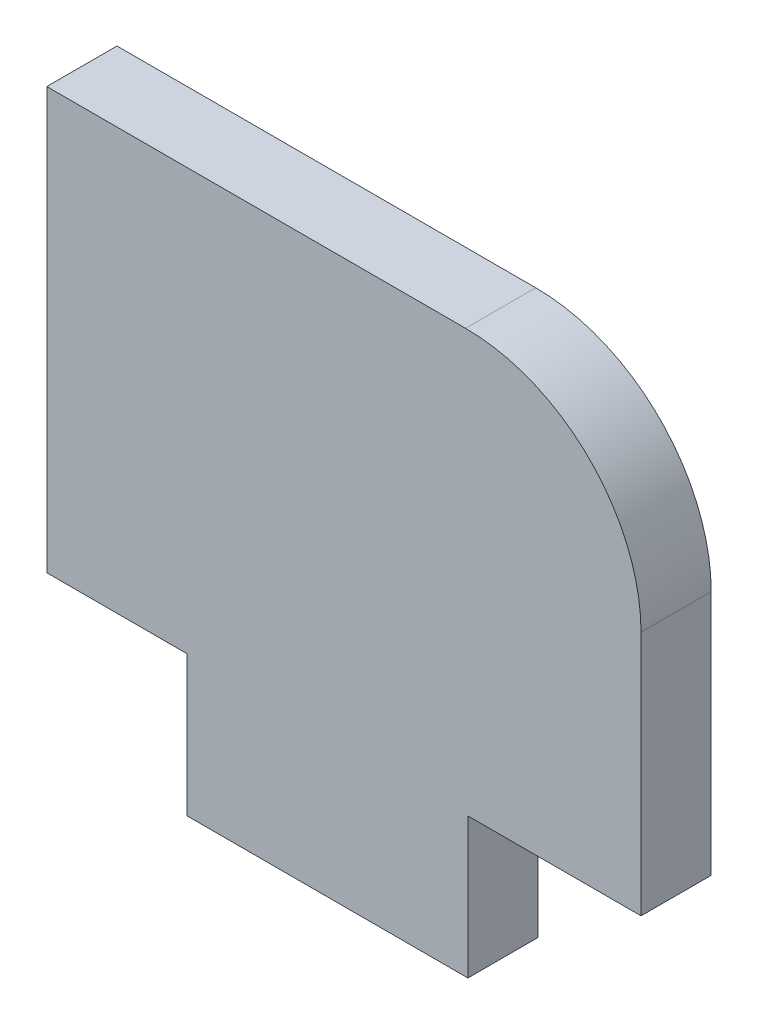
ISO-10303-21;
HEADER;
FILE_DESCRIPTION(('STEP AP214'),'2;1');
FILE_NAME('part.step','',(''),(''),'','','');
FILE_SCHEMA(('AUTOMOTIVE_DESIGN { 1 0 10303 214 1 1 1 1 }'));
ENDSEC;
DATA;
#1=APPLICATION_CONTEXT('core data for automotive mechanical design processes');
#2=APPLICATION_PROTOCOL_DEFINITION('international standard','automotive_design',2000,#1);
#3=PRODUCT_CONTEXT('',#1,'mechanical');
#4=PRODUCT('Part','Part','',(#3));
#5=PRODUCT_RELATED_PRODUCT_CATEGORY('part','',(#4));
#6=PRODUCT_DEFINITION_FORMATION('','',#4);
#7=PRODUCT_DEFINITION_CONTEXT('part definition',#1,'design');
#8=PRODUCT_DEFINITION('design','',#6,#7);
#9=PRODUCT_DEFINITION_SHAPE('','',#8);
#10=(LENGTH_UNIT() NAMED_UNIT(*) SI_UNIT(.MILLI.,.METRE.));
#11=(NAMED_UNIT(*) PLANE_ANGLE_UNIT() SI_UNIT($,.RADIAN.));
#12=(NAMED_UNIT(*) SI_UNIT($,.STERADIAN.) SOLID_ANGLE_UNIT());
#13=UNCERTAINTY_MEASURE_WITH_UNIT(LENGTH_MEASURE(1.E-05),#10,'distance_accuracy_value','');
#14=(GEOMETRIC_REPRESENTATION_CONTEXT(3) GLOBAL_UNCERTAINTY_ASSIGNED_CONTEXT((#13)) GLOBAL_UNIT_ASSIGNED_CONTEXT((#10,
#11,#12)) REPRESENTATION_CONTEXT('',''));
#15=CARTESIAN_POINT('',(0.,0.,0.));
#16=DIRECTION('',(0.,0.,1.));
#17=DIRECTION('',(1.,0.,0.));
#18=AXIS2_PLACEMENT_3D('',#15,#16,#17);
#19=CARTESIAN_POINT('',(-6.46658710236488,-4.,2.));
#20=DIRECTION('',(1.,0.,0.));
#21=DIRECTION('',(0.,0.,-1.));
#22=AXIS2_PLACEMENT_3D('',#19,#20,#21);
#23=PLANE('',#22);
#24=DIRECTION('',(0.,-1.,0.));
#25=VECTOR('',#24,1.);
#26=CARTESIAN_POINT('',(-6.46658710236488,-4.,0.));
#27=LINE('',#26,#25);
#28=CARTESIAN_POINT('',(-6.46658710236488,8.,0.));
#29=VERTEX_POINT('',#28);
#30=CARTESIAN_POINT('',(-6.46658710236488,-4.,0.));
#31=VERTEX_POINT('',#30);
#32=EDGE_CURVE('E135',#29,#31,#27,.T.);
#33=ORIENTED_EDGE('',*,*,#32,.T.);
#34=DIRECTION('',(0.,0.,-1.));
#35=VECTOR('',#34,1.);
#36=CARTESIAN_POINT('',(-6.46658710236488,-4.,2.));
#37=LINE('',#36,#35);
#38=CARTESIAN_POINT('',(-6.46658710236488,-4.,2.));
#39=VERTEX_POINT('',#38);
#40=EDGE_CURVE('E11',#39,#31,#37,.T.);
#41=ORIENTED_EDGE('',*,*,#40,.F.);
#42=DIRECTION('',(0.,-1.,0.));
#43=VECTOR('',#42,1.);
#44=CARTESIAN_POINT('',(-6.46658710236488,-4.,2.));
#45=LINE('',#44,#43);
#46=CARTESIAN_POINT('',(-6.46658710236488,8.,2.));
#47=VERTEX_POINT('',#46);
#48=EDGE_CURVE('E151',#47,#39,#45,.T.);
#49=ORIENTED_EDGE('',*,*,#48,.F.);
#50=DIRECTION('',(0.,0.,-1.));
#51=VECTOR('',#50,1.);
#52=CARTESIAN_POINT('',(-6.46658710236488,8.,2.));
#53=LINE('',#52,#51);
#54=EDGE_CURVE('E131',#47,#29,#53,.T.);
#55=ORIENTED_EDGE('',*,*,#54,.T.);
#56=EDGE_LOOP('',(#33,#41,#49,#55));
#57=FACE_BOUND('',#56,.T.);
#58=ADVANCED_FACE('F33',(#57),#23,.F.);
#59=CARTESIAN_POINT('',(-2.46658710236488,-4.,2.));
#60=DIRECTION('',(0.,1.,0.));
#61=DIRECTION('',(0.,0.,1.));
#62=AXIS2_PLACEMENT_3D('',#59,#60,#61);
#63=PLANE('',#62);
#64=DIRECTION('',(1.,0.,0.));
#65=VECTOR('',#64,1.);
#66=CARTESIAN_POINT('',(-2.46658710236488,-4.,0.));
#67=LINE('',#66,#65);
#68=CARTESIAN_POINT('',(-2.46658710236488,-4.,0.));
#69=VERTEX_POINT('',#68);
#70=EDGE_CURVE('E138',#31,#69,#67,.T.);
#71=ORIENTED_EDGE('',*,*,#70,.T.);
#72=DIRECTION('',(0.,0.,-1.));
#73=VECTOR('',#72,1.);
#74=CARTESIAN_POINT('',(-2.46658710236488,-4.,2.));
#75=LINE('',#74,#73);
#76=CARTESIAN_POINT('',(-2.46658710236488,-4.,2.));
#77=VERTEX_POINT('',#76);
#78=EDGE_CURVE('E41',#77,#69,#75,.T.);
#79=ORIENTED_EDGE('',*,*,#78,.F.);
#80=DIRECTION('',(1.,0.,0.));
#81=VECTOR('',#80,1.);
#82=CARTESIAN_POINT('',(-2.46658710236488,-4.,2.));
#83=LINE('',#82,#81);
#84=EDGE_CURVE('E95',#39,#77,#83,.T.);
#85=ORIENTED_EDGE('',*,*,#84,.F.);
#86=ORIENTED_EDGE('',*,*,#40,.T.);
#87=EDGE_LOOP('',(#71,#79,#85,#86));
#88=FACE_BOUND('',#87,.T.);
#89=ADVANCED_FACE('F194',(#88),#63,.F.);
#90=CARTESIAN_POINT('',(-2.46658710236488,-8.,2.));
#91=DIRECTION('',(1.,0.,0.));
#92=DIRECTION('',(0.,0.,-1.));
#93=AXIS2_PLACEMENT_3D('',#90,#91,#92);
#94=PLANE('',#93);
#95=DIRECTION('',(0.,-1.,0.));
#96=VECTOR('',#95,1.);
#97=CARTESIAN_POINT('',(-2.46658710236488,-8.,0.));
#98=LINE('',#97,#96);
#99=CARTESIAN_POINT('',(-2.46658710236488,-8.,0.));
#100=VERTEX_POINT('',#99);
#101=EDGE_CURVE('E140',#69,#100,#98,.T.);
#102=ORIENTED_EDGE('',*,*,#101,.T.);
#103=DIRECTION('',(0.,0.,-1.));
#104=VECTOR('',#103,1.);
#105=CARTESIAN_POINT('',(-2.46658710236488,-8.,2.));
#106=LINE('',#105,#104);
#107=CARTESIAN_POINT('',(-2.46658710236488,-8.,2.));
#108=VERTEX_POINT('',#107);
#109=EDGE_CURVE('E161',#108,#100,#106,.T.);
#110=ORIENTED_EDGE('',*,*,#109,.F.);
#111=DIRECTION('',(0.,-1.,0.));
#112=VECTOR('',#111,1.);
#113=CARTESIAN_POINT('',(-2.46658710236488,-8.,2.));
#114=LINE('',#113,#112);
#115=EDGE_CURVE('E169',#77,#108,#114,.T.);
#116=ORIENTED_EDGE('',*,*,#115,.F.);
#117=ORIENTED_EDGE('',*,*,#78,.T.);
#118=EDGE_LOOP('',(#102,#110,#116,#117));
#119=FACE_BOUND('',#118,.T.);
#120=ADVANCED_FACE('F167',(#119),#94,.F.);
#121=CARTESIAN_POINT('',(5.53341289763512,-8.,2.));
#122=DIRECTION('',(0.,1.,0.));
#123=DIRECTION('',(0.,0.,1.));
#124=AXIS2_PLACEMENT_3D('',#121,#122,#123);
#125=PLANE('',#124);
#126=DIRECTION('',(1.,0.,0.));
#127=VECTOR('',#126,1.);
#128=CARTESIAN_POINT('',(5.53341289763512,-8.,0.));
#129=LINE('',#128,#127);
#130=CARTESIAN_POINT('',(5.53341289763512,-8.,0.));
#131=VERTEX_POINT('',#130);
#132=EDGE_CURVE('E142',#100,#131,#129,.T.);
#133=ORIENTED_EDGE('',*,*,#132,.T.);
#134=DIRECTION('',(0.,0.,-1.));
#135=VECTOR('',#134,1.);
#136=CARTESIAN_POINT('',(5.53341289763512,-8.,2.));
#137=LINE('',#136,#135);
#138=CARTESIAN_POINT('',(5.53341289763512,-8.,2.));
#139=VERTEX_POINT('',#138);
#140=EDGE_CURVE('E158',#139,#131,#137,.T.);
#141=ORIENTED_EDGE('',*,*,#140,.F.);
#142=DIRECTION('',(1.,0.,0.));
#143=VECTOR('',#142,1.);
#144=CARTESIAN_POINT('',(5.53341289763512,-8.,2.));
#145=LINE('',#144,#143);
#146=EDGE_CURVE('E185',#108,#139,#145,.T.);
#147=ORIENTED_EDGE('',*,*,#146,.F.);
#148=ORIENTED_EDGE('',*,*,#109,.T.);
#149=EDGE_LOOP('',(#133,#141,#147,#148));
#150=FACE_BOUND('',#149,.T.);
#151=ADVANCED_FACE('F178',(#150),#125,.F.);
#152=CARTESIAN_POINT('',(5.53341289763512,-4.,2.));
#153=DIRECTION('',(-1.,0.,0.));
#154=DIRECTION('',(0.,0.,1.));
#155=AXIS2_PLACEMENT_3D('',#152,#153,#154);
#156=PLANE('',#155);
#157=DIRECTION('',(0.,1.,0.));
#158=VECTOR('',#157,1.);
#159=CARTESIAN_POINT('',(5.53341289763512,-4.,0.));
#160=LINE('',#159,#158);
#161=CARTESIAN_POINT('',(5.53341289763512,-4.,0.));
#162=VERTEX_POINT('',#161);
#163=EDGE_CURVE('E144',#131,#162,#160,.T.);
#164=ORIENTED_EDGE('',*,*,#163,.T.);
#165=DIRECTION('',(0.,0.,-1.));
#166=VECTOR('',#165,1.);
#167=CARTESIAN_POINT('',(5.53341289763512,-4.,2.));
#168=LINE('',#167,#166);
#169=CARTESIAN_POINT('',(5.53341289763512,-4.,2.));
#170=VERTEX_POINT('',#169);
#171=EDGE_CURVE('E155',#170,#162,#168,.T.);
#172=ORIENTED_EDGE('',*,*,#171,.F.);
#173=DIRECTION('',(0.,1.,0.));
#174=VECTOR('',#173,1.);
#175=CARTESIAN_POINT('',(5.53341289763512,-4.,2.));
#176=LINE('',#175,#174);
#177=EDGE_CURVE('E184',#139,#170,#176,.T.);
#178=ORIENTED_EDGE('',*,*,#177,.F.);
#179=ORIENTED_EDGE('',*,*,#140,.T.);
#180=EDGE_LOOP('',(#164,#172,#178,#179));
#181=FACE_BOUND('',#180,.T.);
#182=ADVANCED_FACE('F182',(#181),#156,.F.);
#183=CARTESIAN_POINT('',(5.53341289763512,-4.,2.));
#184=DIRECTION('',(0.,1.,0.));
#185=DIRECTION('',(0.,0.,1.));
#186=AXIS2_PLACEMENT_3D('',#183,#184,#185);
#187=PLANE('',#186);
#188=DIRECTION('',(1.,0.,0.));
#189=VECTOR('',#188,1.);
#190=CARTESIAN_POINT('',(5.53341289763512,-4.,0.));
#191=LINE('',#190,#189);
#192=CARTESIAN_POINT('',(10.4665871023649,-4.,0.));
#193=VERTEX_POINT('',#192);
#194=EDGE_CURVE('E146',#162,#193,#191,.T.);
#195=ORIENTED_EDGE('',*,*,#194,.T.);
#196=DIRECTION('',(0.,0.,-1.));
#197=VECTOR('',#196,1.);
#198=CARTESIAN_POINT('',(10.4665871023649,-4.,2.));
#199=LINE('',#198,#197);
#200=CARTESIAN_POINT('',(10.4665871023649,-4.,2.));
#201=VERTEX_POINT('',#200);
#202=EDGE_CURVE('E126',#201,#193,#199,.T.);
#203=ORIENTED_EDGE('',*,*,#202,.F.);
#204=DIRECTION('',(1.,0.,0.));
#205=VECTOR('',#204,1.);
#206=CARTESIAN_POINT('',(5.53341289763512,-4.,2.));
#207=LINE('',#206,#205);
#208=EDGE_CURVE('E117',#170,#201,#207,.T.);
#209=ORIENTED_EDGE('',*,*,#208,.F.);
#210=ORIENTED_EDGE('',*,*,#171,.T.);
#211=EDGE_LOOP('',(#195,#203,#209,#210));
#212=FACE_BOUND('',#211,.T.);
#213=ADVANCED_FACE('F206',(#212),#187,.F.);
#214=CARTESIAN_POINT('',(10.4665871023649,3.,2.));
#215=DIRECTION('',(-1.,0.,0.));
#216=DIRECTION('',(0.,0.,1.));
#217=AXIS2_PLACEMENT_3D('',#214,#215,#216);
#218=PLANE('',#217);
#219=DIRECTION('',(0.,1.,0.));
#220=VECTOR('',#219,1.);
#221=CARTESIAN_POINT('',(10.4665871023649,3.,0.));
#222=LINE('',#221,#220);
#223=CARTESIAN_POINT('',(10.4665871023649,3.,0.));
#224=VERTEX_POINT('',#223);
#225=EDGE_CURVE('E125',#193,#224,#222,.T.);
#226=ORIENTED_EDGE('',*,*,#225,.T.);
#227=DIRECTION('',(0.,0.,-1.));
#228=VECTOR('',#227,1.);
#229=CARTESIAN_POINT('',(10.4665871023649,3.,2.));
#230=LINE('',#229,#228);
#231=CARTESIAN_POINT('',(10.4665871023649,3.,2.));
#232=VERTEX_POINT('',#231);
#233=EDGE_CURVE('E122',#232,#224,#230,.T.);
#234=ORIENTED_EDGE('',*,*,#233,.F.);
#235=DIRECTION('',(0.,1.,0.));
#236=VECTOR('',#235,1.);
#237=CARTESIAN_POINT('',(10.4665871023649,3.,2.));
#238=LINE('',#237,#236);
#239=EDGE_CURVE('E111',#201,#232,#238,.T.);
#240=ORIENTED_EDGE('',*,*,#239,.F.);
#241=ORIENTED_EDGE('',*,*,#202,.T.);
#242=EDGE_LOOP('',(#226,#234,#240,#241));
#243=FACE_BOUND('',#242,.T.);
#244=ADVANCED_FACE('F123',(#243),#218,.F.);
#245=CARTESIAN_POINT('',(5.46658710236488,3.,2.));
#246=DIRECTION('',(0.,0.,-1.));
#247=DIRECTION('',(-1.,0.,0.));
#248=AXIS2_PLACEMENT_3D('',#245,#246,#247);
#249=CYLINDRICAL_SURFACE('',#248,5.);
#250=CARTESIAN_POINT('',(5.46658710236488,3.,0.));
#251=DIRECTION('',(0.,0.,1.));
#252=DIRECTION('',(1.,0.,0.));
#253=AXIS2_PLACEMENT_3D('',#250,#251,#252);
#254=CIRCLE('',#253,5.);
#255=CARTESIAN_POINT('',(5.46658710236488,8.,0.));
#256=VERTEX_POINT('',#255);
#257=EDGE_CURVE('E81',#224,#256,#254,.T.);
#258=ORIENTED_EDGE('',*,*,#257,.T.);
#259=DIRECTION('',(0.,0.,-1.));
#260=VECTOR('',#259,1.);
#261=CARTESIAN_POINT('',(5.46658710236488,8.,2.));
#262=LINE('',#261,#260);
#263=CARTESIAN_POINT('',(5.46658710236488,8.,2.));
#264=VERTEX_POINT('',#263);
#265=EDGE_CURVE('E127',#264,#256,#262,.T.);
#266=ORIENTED_EDGE('',*,*,#265,.F.);
#267=CARTESIAN_POINT('',(5.46658710236488,3.,2.));
#268=DIRECTION('',(0.,0.,1.));
#269=DIRECTION('',(1.,0.,0.));
#270=AXIS2_PLACEMENT_3D('',#267,#268,#269);
#271=CIRCLE('',#270,5.);
#272=EDGE_CURVE('E115',#232,#264,#271,.T.);
#273=ORIENTED_EDGE('',*,*,#272,.F.);
#274=ORIENTED_EDGE('',*,*,#233,.T.);
#275=EDGE_LOOP('',(#258,#266,#273,#274));
#276=FACE_BOUND('',#275,.T.);
#277=ADVANCED_FACE('F129',(#276),#249,.T.);
#278=CARTESIAN_POINT('',(-6.46658710236488,8.,2.));
#279=DIRECTION('',(0.,-1.,0.));
#280=DIRECTION('',(0.,0.,-1.));
#281=AXIS2_PLACEMENT_3D('',#278,#279,#280);
#282=PLANE('',#281);
#283=DIRECTION('',(-1.,0.,0.));
#284=VECTOR('',#283,1.);
#285=CARTESIAN_POINT('',(-6.46658710236488,8.,0.));
#286=LINE('',#285,#284);
#287=EDGE_CURVE('E87',#256,#29,#286,.T.);
#288=ORIENTED_EDGE('',*,*,#287,.T.);
#289=ORIENTED_EDGE('',*,*,#54,.F.);
#290=DIRECTION('',(-1.,0.,0.));
#291=VECTOR('',#290,1.);
#292=CARTESIAN_POINT('',(-6.46658710236488,8.,2.));
#293=LINE('',#292,#291);
#294=EDGE_CURVE('E49',#264,#47,#293,.T.);
#295=ORIENTED_EDGE('',*,*,#294,.F.);
#296=ORIENTED_EDGE('',*,*,#265,.T.);
#297=EDGE_LOOP('',(#288,#289,#295,#296));
#298=FACE_BOUND('',#297,.T.);
#299=ADVANCED_FACE('F214',(#298),#282,.F.);
#300=CARTESIAN_POINT('',(5.46658710236488,3.,2.));
#301=DIRECTION('',(0.,0.,1.));
#302=DIRECTION('',(1.,0.,0.));
#303=AXIS2_PLACEMENT_3D('',#300,#301,#302);
#304=PLANE('',#303);
#305=ORIENTED_EDGE('',*,*,#48,.T.);
#306=ORIENTED_EDGE('',*,*,#84,.T.);
#307=ORIENTED_EDGE('',*,*,#115,.T.);
#308=ORIENTED_EDGE('',*,*,#146,.T.);
#309=ORIENTED_EDGE('',*,*,#177,.T.);
#310=ORIENTED_EDGE('',*,*,#208,.T.);
#311=ORIENTED_EDGE('',*,*,#239,.T.);
#312=ORIENTED_EDGE('',*,*,#272,.T.);
#313=ORIENTED_EDGE('',*,*,#294,.T.);
#314=EDGE_LOOP('',(#305,#306,#307,#308,#309,#310,#311,#312,#313));
#315=FACE_BOUND('',#314,.T.);
#316=ADVANCED_FACE('F113',(#315),#304,.T.);
#317=CARTESIAN_POINT('',(5.46658710236488,3.,0.));
#318=DIRECTION('',(0.,0.,1.));
#319=DIRECTION('',(1.,0.,0.));
#320=AXIS2_PLACEMENT_3D('',#317,#318,#319);
#321=PLANE('',#320);
#322=ORIENTED_EDGE('',*,*,#32,.F.);
#323=ORIENTED_EDGE('',*,*,#287,.F.);
#324=ORIENTED_EDGE('',*,*,#257,.F.);
#325=ORIENTED_EDGE('',*,*,#225,.F.);
#326=ORIENTED_EDGE('',*,*,#194,.F.);
#327=ORIENTED_EDGE('',*,*,#163,.F.);
#328=ORIENTED_EDGE('',*,*,#132,.F.);
#329=ORIENTED_EDGE('',*,*,#101,.F.);
#330=ORIENTED_EDGE('',*,*,#70,.F.);
#331=EDGE_LOOP('',(#322,#323,#324,#325,#326,#327,#328,#329,#330));
#332=FACE_BOUND('',#331,.T.);
#333=ADVANCED_FACE('F173',(#332),#321,.F.);
#334=CLOSED_SHELL('',(#58,#89,#120,#151,#182,#213,#244,#277,#299,#316,#333));
#335=MANIFOLD_SOLID_BREP('B2',#334);
#336=ADVANCED_BREP_SHAPE_REPRESENTATION('',(#18,#335),#14);
#337=SHAPE_DEFINITION_REPRESENTATION(#9,#336);
ENDSEC;
END-ISO-10303-21;
